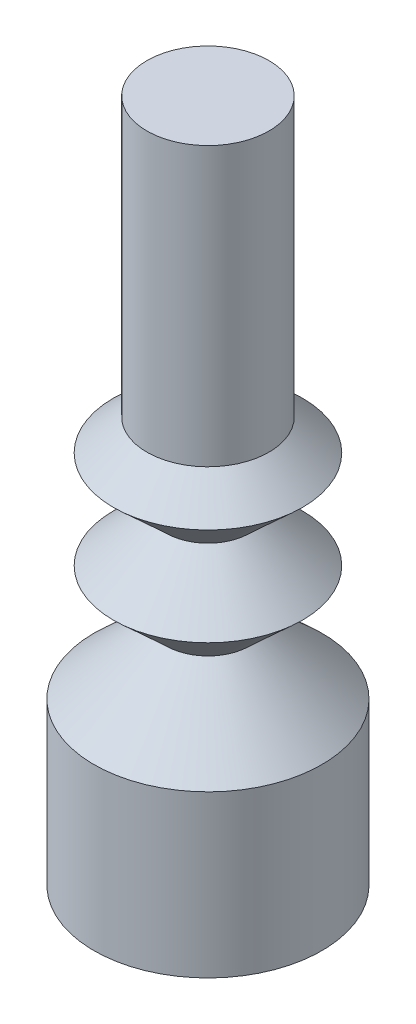
ISO-10303-21;
HEADER;
FILE_DESCRIPTION(('STEP AP214'),'2;1');
FILE_NAME('part.step','',(''),(''),'','','');
FILE_SCHEMA(('AUTOMOTIVE_DESIGN { 1 0 10303 214 1 1 1 1 }'));
ENDSEC;
DATA;
#1=APPLICATION_CONTEXT('core data for automotive mechanical design processes');
#2=APPLICATION_PROTOCOL_DEFINITION('international standard','automotive_design',2000,#1);
#3=PRODUCT_CONTEXT('',#1,'mechanical');
#4=PRODUCT('Part','Part','',(#3));
#5=PRODUCT_RELATED_PRODUCT_CATEGORY('part','',(#4));
#6=PRODUCT_DEFINITION_FORMATION('','',#4);
#7=PRODUCT_DEFINITION_CONTEXT('part definition',#1,'design');
#8=PRODUCT_DEFINITION('design','',#6,#7);
#9=PRODUCT_DEFINITION_SHAPE('','',#8);
#10=(LENGTH_UNIT() NAMED_UNIT(*) SI_UNIT(.MILLI.,.METRE.));
#11=(NAMED_UNIT(*) PLANE_ANGLE_UNIT() SI_UNIT($,.RADIAN.));
#12=(NAMED_UNIT(*) SI_UNIT($,.STERADIAN.) SOLID_ANGLE_UNIT());
#13=UNCERTAINTY_MEASURE_WITH_UNIT(LENGTH_MEASURE(1.E-05),#10,'distance_accuracy_value','');
#14=(GEOMETRIC_REPRESENTATION_CONTEXT(3) GLOBAL_UNCERTAINTY_ASSIGNED_CONTEXT((#13)) GLOBAL_UNIT_ASSIGNED_CONTEXT((#10,
#11,#12)) REPRESENTATION_CONTEXT('',''));
#15=CARTESIAN_POINT('',(0.,0.,0.));
#16=DIRECTION('',(0.,0.,1.));
#17=DIRECTION('',(1.,0.,0.));
#18=AXIS2_PLACEMENT_3D('',#15,#16,#17);
#19=CARTESIAN_POINT('',(0.,-12.5,0.));
#20=DIRECTION('',(0.,1.,0.));
#21=DIRECTION('',(-1.,0.,0.));
#22=AXIS2_PLACEMENT_3D('',#19,#20,#21);
#23=PLANE('',#22);
#24=CARTESIAN_POINT('',(0.,-12.5,0.));
#25=DIRECTION('',(0.,1.,0.));
#26=DIRECTION('',(-1.,0.,0.));
#27=AXIS2_PLACEMENT_3D('',#24,#25,#26);
#28=CIRCLE('',#27,3.5);
#29=CARTESIAN_POINT('',(-3.50000000000001,-12.5,0.));
#30=VERTEX_POINT('',#29);
#31=EDGE_CURVE('E58',#30,#30,#28,.T.);
#32=ORIENTED_EDGE('',*,*,#31,.F.);
#33=EDGE_LOOP('',(#32));
#34=FACE_BOUND('',#33,.T.);
#35=ADVANCED_FACE('F30',(#34),#23,.F.);
#36=CARTESIAN_POINT('',(0.,8.5,0.));
#37=DIRECTION('',(0.,-1.,0.));
#38=DIRECTION('',(1.,0.,0.));
#39=AXIS2_PLACEMENT_3D('',#36,#37,#38);
#40=PLANE('',#39);
#41=CARTESIAN_POINT('',(0.,8.5,0.));
#42=DIRECTION('',(0.,1.,0.));
#43=DIRECTION('',(-1.,0.,0.));
#44=AXIS2_PLACEMENT_3D('',#41,#42,#43);
#45=CIRCLE('',#44,1.87500000000001);
#46=CARTESIAN_POINT('',(-1.87500000000001,8.5,0.));
#47=VERTEX_POINT('',#46);
#48=EDGE_CURVE('E10',#47,#47,#45,.T.);
#49=ORIENTED_EDGE('',*,*,#48,.T.);
#50=EDGE_LOOP('',(#49));
#51=FACE_BOUND('',#50,.T.);
#52=ADVANCED_FACE('F65',(#51),#40,.F.);
#53=CARTESIAN_POINT('',(0.,12.5,0.));
#54=DIRECTION('',(0.,1.,0.));
#55=DIRECTION('',(-1.,0.,0.));
#56=AXIS2_PLACEMENT_3D('',#53,#54,#55);
#57=CYLINDRICAL_SURFACE('',#56,1.875);
#58=ORIENTED_EDGE('',*,*,#48,.F.);
#59=EDGE_LOOP('',(#58));
#60=FACE_BOUND('',#59,.T.);
#61=CARTESIAN_POINT('',(0.,-0.0472890397071289,0.));
#62=DIRECTION('',(0.,1.,0.));
#63=DIRECTION('',(-1.,0.,0.));
#64=AXIS2_PLACEMENT_3D('',#61,#62,#63);
#65=CIRCLE('',#64,1.875);
#66=CARTESIAN_POINT('',(-1.87500000000001,-0.0472890397071292,0.));
#67=VERTEX_POINT('',#66);
#68=EDGE_CURVE('E36',#67,#67,#65,.T.);
#69=ORIENTED_EDGE('',*,*,#68,.T.);
#70=EDGE_LOOP('',(#69));
#71=FACE_BOUND('',#70,.T.);
#72=ADVANCED_FACE('F69',(#60,#71),#57,.T.);
#73=CARTESIAN_POINT('',(0.,-1.,0.));
#74=DIRECTION('',(0.,-1.,0.));
#75=DIRECTION('',(1.,0.,0.));
#76=AXIS2_PLACEMENT_3D('',#73,#74,#75);
#77=CONICAL_SURFACE('',#76,2.90710354031728,0.825376850520738);
#78=ORIENTED_EDGE('',*,*,#68,.F.);
#79=EDGE_LOOP('',(#78));
#80=FACE_BOUND('',#79,.T.);
#81=CARTESIAN_POINT('',(0.,-1.,0.));
#82=DIRECTION('',(0.,1.,0.));
#83=DIRECTION('',(-1.,0.,0.));
#84=AXIS2_PLACEMENT_3D('',#81,#82,#83);
#85=CIRCLE('',#84,2.90710354031728);
#86=CARTESIAN_POINT('',(-2.90710354031729,-1.,0.));
#87=VERTEX_POINT('',#86);
#88=EDGE_CURVE('E40',#87,#87,#85,.T.);
#89=ORIENTED_EDGE('',*,*,#88,.T.);
#90=EDGE_LOOP('',(#89));
#91=FACE_BOUND('',#90,.T.);
#92=ADVANCED_FACE('F73',(#80,#91),#77,.T.);
#93=CARTESIAN_POINT('',(0.,-2.5,0.));
#94=DIRECTION('',(0.,1.,0.));
#95=DIRECTION('',(-1.,0.,0.));
#96=AXIS2_PLACEMENT_3D('',#93,#94,#95);
#97=CONICAL_SURFACE('',#96,1.28210354031728,0.825376850520739);
#98=ORIENTED_EDGE('',*,*,#88,.F.);
#99=EDGE_LOOP('',(#98));
#100=FACE_BOUND('',#99,.T.);
#101=CARTESIAN_POINT('',(0.,-2.5,0.));
#102=DIRECTION('',(0.,1.,0.));
#103=DIRECTION('',(-1.,0.,0.));
#104=AXIS2_PLACEMENT_3D('',#101,#102,#103);
#105=CIRCLE('',#104,1.28210354031728);
#106=CARTESIAN_POINT('',(-1.28210354031729,-2.5,0.));
#107=VERTEX_POINT('',#106);
#108=EDGE_CURVE('E44',#107,#107,#105,.T.);
#109=ORIENTED_EDGE('',*,*,#108,.T.);
#110=EDGE_LOOP('',(#109));
#111=FACE_BOUND('',#110,.T.);
#112=ADVANCED_FACE('F79',(#100,#111),#97,.T.);
#113=CARTESIAN_POINT('',(0.,-4.,0.));
#114=DIRECTION('',(0.,-1.,0.));
#115=DIRECTION('',(1.,0.,0.));
#116=AXIS2_PLACEMENT_3D('',#113,#114,#115);
#117=CONICAL_SURFACE('',#116,2.90710354031728,0.825376850520739);
#118=ORIENTED_EDGE('',*,*,#108,.F.);
#119=EDGE_LOOP('',(#118));
#120=FACE_BOUND('',#119,.T.);
#121=CARTESIAN_POINT('',(0.,-4.,0.));
#122=DIRECTION('',(0.,1.,0.));
#123=DIRECTION('',(-1.,0.,0.));
#124=AXIS2_PLACEMENT_3D('',#121,#122,#123);
#125=CIRCLE('',#124,2.90710354031728);
#126=CARTESIAN_POINT('',(-2.90710354031729,-4.,0.));
#127=VERTEX_POINT('',#126);
#128=EDGE_CURVE('E49',#127,#127,#125,.T.);
#129=ORIENTED_EDGE('',*,*,#128,.T.);
#130=EDGE_LOOP('',(#129));
#131=FACE_BOUND('',#130,.T.);
#132=ADVANCED_FACE('F83',(#120,#131),#117,.T.);
#133=CARTESIAN_POINT('',(0.,-5.5,0.));
#134=DIRECTION('',(0.,1.,0.));
#135=DIRECTION('',(-1.,0.,0.));
#136=AXIS2_PLACEMENT_3D('',#133,#134,#135);
#137=CONICAL_SURFACE('',#136,1.28210354031728,0.825376850520738);
#138=ORIENTED_EDGE('',*,*,#128,.F.);
#139=EDGE_LOOP('',(#138));
#140=FACE_BOUND('',#139,.T.);
#141=CARTESIAN_POINT('',(0.,-5.5,0.));
#142=DIRECTION('',(0.,1.,0.));
#143=DIRECTION('',(-1.,0.,0.));
#144=AXIS2_PLACEMENT_3D('',#141,#142,#143);
#145=CIRCLE('',#144,1.28210354031728);
#146=CARTESIAN_POINT('',(-1.28210354031728,-5.5,0.));
#147=VERTEX_POINT('',#146);
#148=EDGE_CURVE('E52',#147,#147,#145,.T.);
#149=ORIENTED_EDGE('',*,*,#148,.T.);
#150=EDGE_LOOP('',(#149));
#151=FACE_BOUND('',#150,.T.);
#152=ADVANCED_FACE('F87',(#140,#151),#137,.T.);
#153=CARTESIAN_POINT('',(0.,-7.54728903970713,0.));
#154=DIRECTION('',(0.,-1.,0.));
#155=DIRECTION('',(1.,0.,0.));
#156=AXIS2_PLACEMENT_3D('',#153,#154,#155);
#157=CONICAL_SURFACE('',#156,3.5,0.825376850520739);
#158=ORIENTED_EDGE('',*,*,#148,.F.);
#159=EDGE_LOOP('',(#158));
#160=FACE_BOUND('',#159,.T.);
#161=CARTESIAN_POINT('',(0.,-7.54728903970713,0.));
#162=DIRECTION('',(0.,1.,0.));
#163=DIRECTION('',(-1.,0.,0.));
#164=AXIS2_PLACEMENT_3D('',#161,#162,#163);
#165=CIRCLE('',#164,3.5);
#166=CARTESIAN_POINT('',(-3.50000000000001,-7.54728903970713,0.));
#167=VERTEX_POINT('',#166);
#168=EDGE_CURVE('E55',#167,#167,#165,.T.);
#169=ORIENTED_EDGE('',*,*,#168,.T.);
#170=EDGE_LOOP('',(#169));
#171=FACE_BOUND('',#170,.T.);
#172=ADVANCED_FACE('F91',(#160,#171),#157,.T.);
#173=CARTESIAN_POINT('',(0.,12.5,0.));
#174=DIRECTION('',(0.,1.,0.));
#175=DIRECTION('',(-1.,0.,0.));
#176=AXIS2_PLACEMENT_3D('',#173,#174,#175);
#177=CYLINDRICAL_SURFACE('',#176,3.5);
#178=ORIENTED_EDGE('',*,*,#168,.F.);
#179=EDGE_LOOP('',(#178));
#180=FACE_BOUND('',#179,.T.);
#181=ORIENTED_EDGE('',*,*,#31,.T.);
#182=EDGE_LOOP('',(#181));
#183=FACE_BOUND('',#182,.T.);
#184=ADVANCED_FACE('F62',(#180,#183),#177,.T.);
#185=CLOSED_SHELL('',(#35,#52,#72,#92,#112,#132,#152,#172,#184));
#186=MANIFOLD_SOLID_BREP('B2',#185);
#187=ADVANCED_BREP_SHAPE_REPRESENTATION('',(#18,#186),#14);
#188=SHAPE_DEFINITION_REPRESENTATION(#9,#187);
ENDSEC;
END-ISO-10303-21;
